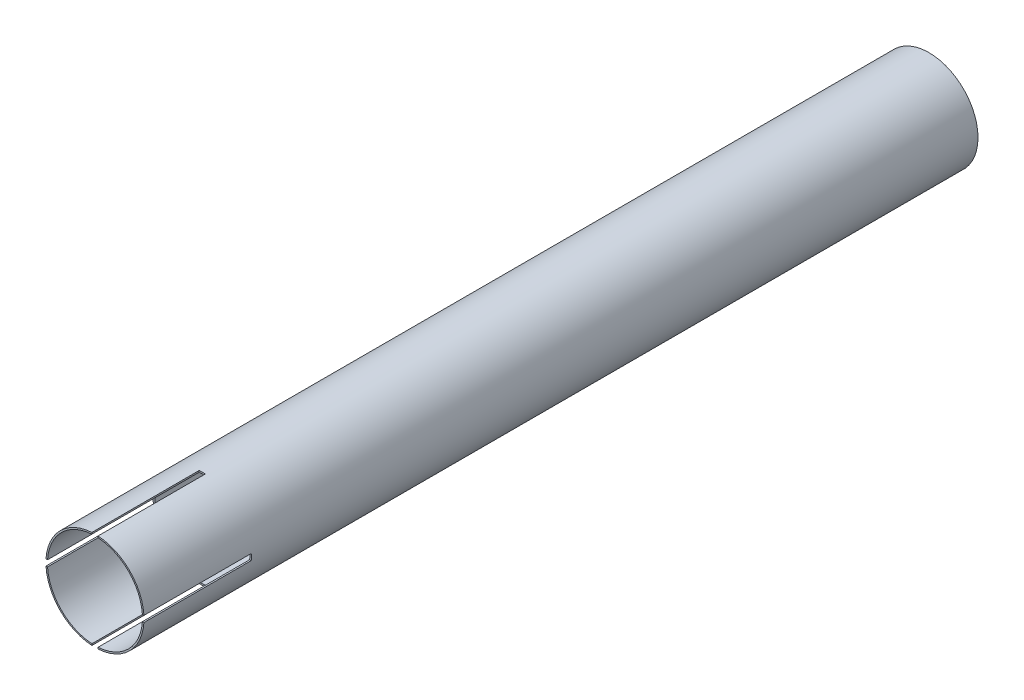
ISO-10303-21;
HEADER;
FILE_DESCRIPTION(('STEP AP214'),'2;1');
FILE_NAME('part.step','',(''),(''),'','','');
FILE_SCHEMA(('AUTOMOTIVE_DESIGN { 1 0 10303 214 1 1 1 1 }'));
ENDSEC;
DATA;
#1=APPLICATION_CONTEXT('core data for automotive mechanical design processes');
#2=APPLICATION_PROTOCOL_DEFINITION('international standard','automotive_design',2000,#1);
#3=PRODUCT_CONTEXT('',#1,'mechanical');
#4=PRODUCT('Part','Part','',(#3));
#5=PRODUCT_RELATED_PRODUCT_CATEGORY('part','',(#4));
#6=PRODUCT_DEFINITION_FORMATION('','',#4);
#7=PRODUCT_DEFINITION_CONTEXT('part definition',#1,'design');
#8=PRODUCT_DEFINITION('design','',#6,#7);
#9=PRODUCT_DEFINITION_SHAPE('','',#8);
#10=(LENGTH_UNIT() NAMED_UNIT(*) SI_UNIT(.MILLI.,.METRE.));
#11=(NAMED_UNIT(*) PLANE_ANGLE_UNIT() SI_UNIT($,.RADIAN.));
#12=(NAMED_UNIT(*) SI_UNIT($,.STERADIAN.) SOLID_ANGLE_UNIT());
#13=UNCERTAINTY_MEASURE_WITH_UNIT(LENGTH_MEASURE(1.E-05),#10,'distance_accuracy_value','');
#14=(GEOMETRIC_REPRESENTATION_CONTEXT(3) GLOBAL_UNCERTAINTY_ASSIGNED_CONTEXT((#13)) GLOBAL_UNIT_ASSIGNED_CONTEXT((#10,
#11,#12)) REPRESENTATION_CONTEXT('',''));
#15=CARTESIAN_POINT('',(0.,0.,0.));
#16=DIRECTION('',(0.,0.,1.));
#17=DIRECTION('',(1.,0.,0.));
#18=AXIS2_PLACEMENT_3D('',#15,#16,#17);
#19=CARTESIAN_POINT('',(0.,0.,863.6));
#20=DIRECTION('',(0.,0.,1.));
#21=DIRECTION('',(1.,0.,0.));
#22=AXIS2_PLACEMENT_3D('',#19,#20,#21);
#23=PLANE('',#22);
#24=DIRECTION('',(1.,0.,0.));
#25=VECTOR('',#24,1.);
#26=CARTESIAN_POINT('',(-50.8,3.175,863.6));
#27=LINE('',#26,#25);
#28=CARTESIAN_POINT('',(49.1099738469692,3.175,863.6));
#29=VERTEX_POINT('',#28);
#30=CARTESIAN_POINT('',(50.7006841669814,3.175,863.6));
#31=VERTEX_POINT('',#30);
#32=EDGE_CURVE('E289',#29,#31,#27,.T.);
#33=ORIENTED_EDGE('',*,*,#32,.T.);
#34=CARTESIAN_POINT('',(0.,0.,863.6));
#35=DIRECTION('',(0.,0.,1.));
#36=DIRECTION('',(1.,0.,0.));
#37=AXIS2_PLACEMENT_3D('',#34,#35,#36);
#38=CIRCLE('',#37,50.8);
#39=CARTESIAN_POINT('',(3.17500000000001,50.7006841669814,863.6));
#40=VERTEX_POINT('',#39);
#41=EDGE_CURVE('E247',#31,#40,#38,.T.);
#42=ORIENTED_EDGE('',*,*,#41,.T.);
#43=DIRECTION('',(0.,1.,0.));
#44=VECTOR('',#43,1.);
#45=CARTESIAN_POINT('',(3.17500000000001,-50.8,863.6));
#46=LINE('',#45,#44);
#47=CARTESIAN_POINT('',(3.17500000000001,49.1099738469692,863.6));
#48=VERTEX_POINT('',#47);
#49=EDGE_CURVE('E194',#48,#40,#46,.T.);
#50=ORIENTED_EDGE('',*,*,#49,.F.);
#51=CARTESIAN_POINT('',(0.,0.,863.6));
#52=DIRECTION('',(0.,0.,1.));
#53=DIRECTION('',(1.,0.,0.));
#54=AXIS2_PLACEMENT_3D('',#51,#52,#53);
#55=CIRCLE('',#54,49.2125);
#56=EDGE_CURVE('E238',#29,#48,#55,.T.);
#57=ORIENTED_EDGE('',*,*,#56,.F.);
#58=EDGE_LOOP('',(#33,#42,#50,#57));
#59=FACE_BOUND('',#58,.T.);
#60=ADVANCED_FACE('F38',(#59),#23,.T.);
#61=CARTESIAN_POINT('',(-50.7006841669814,3.175,863.6));
#62=VERTEX_POINT('',#61);
#63=CARTESIAN_POINT('',(-49.1099738469692,3.175,863.6));
#64=VERTEX_POINT('',#63);
#65=EDGE_CURVE('E182',#62,#64,#27,.T.);
#66=ORIENTED_EDGE('',*,*,#65,.T.);
#67=CARTESIAN_POINT('',(-3.175,49.1099738469692,863.6));
#68=VERTEX_POINT('',#67);
#69=EDGE_CURVE('E239',#68,#64,#55,.T.);
#70=ORIENTED_EDGE('',*,*,#69,.F.);
#71=DIRECTION('',(0.,1.,0.));
#72=VECTOR('',#71,1.);
#73=CARTESIAN_POINT('',(-3.175,-50.8,863.6));
#74=LINE('',#73,#72);
#75=CARTESIAN_POINT('',(-3.175,50.7006841669814,863.6));
#76=VERTEX_POINT('',#75);
#77=EDGE_CURVE('E200',#68,#76,#74,.T.);
#78=ORIENTED_EDGE('',*,*,#77,.T.);
#79=EDGE_CURVE('E248',#76,#62,#38,.T.);
#80=ORIENTED_EDGE('',*,*,#79,.T.);
#81=EDGE_LOOP('',(#66,#70,#78,#80));
#82=FACE_BOUND('',#81,.T.);
#83=ADVANCED_FACE('F322',(#82),#23,.T.);
#84=DIRECTION('',(1.,0.,0.));
#85=VECTOR('',#84,1.);
#86=CARTESIAN_POINT('',(-50.8,-3.175,863.6));
#87=LINE('',#86,#85);
#88=CARTESIAN_POINT('',(49.1099738469692,-3.175,863.6));
#89=VERTEX_POINT('',#88);
#90=CARTESIAN_POINT('',(50.7006841669814,-3.175,863.6));
#91=VERTEX_POINT('',#90);
#92=EDGE_CURVE('E361',#89,#91,#87,.T.);
#93=ORIENTED_EDGE('',*,*,#92,.F.);
#94=CARTESIAN_POINT('',(3.17500000000001,-49.1099738469692,863.6));
#95=VERTEX_POINT('',#94);
#96=EDGE_CURVE('E233',#95,#89,#55,.T.);
#97=ORIENTED_EDGE('',*,*,#96,.F.);
#98=CARTESIAN_POINT('',(3.17500000000001,-50.7006841669814,863.6));
#99=VERTEX_POINT('',#98);
#100=EDGE_CURVE('E198',#99,#95,#46,.T.);
#101=ORIENTED_EDGE('',*,*,#100,.F.);
#102=EDGE_CURVE('E243',#99,#91,#38,.T.);
#103=ORIENTED_EDGE('',*,*,#102,.T.);
#104=EDGE_LOOP('',(#93,#97,#101,#103));
#105=FACE_BOUND('',#104,.T.);
#106=ADVANCED_FACE('F349',(#105),#23,.T.);
#107=CARTESIAN_POINT('',(-50.7006841669814,-3.175,863.6));
#108=VERTEX_POINT('',#107);
#109=CARTESIAN_POINT('',(-49.1099738469692,-3.175,863.6));
#110=VERTEX_POINT('',#109);
#111=EDGE_CURVE('E62',#108,#110,#87,.T.);
#112=ORIENTED_EDGE('',*,*,#111,.F.);
#113=CARTESIAN_POINT('',(-3.175,-50.7006841669814,863.6));
#114=VERTEX_POINT('',#113);
#115=EDGE_CURVE('E176',#108,#114,#38,.T.);
#116=ORIENTED_EDGE('',*,*,#115,.T.);
#117=CARTESIAN_POINT('',(-3.175,-49.1099738469692,863.6));
#118=VERTEX_POINT('',#117);
#119=EDGE_CURVE('E199',#114,#118,#74,.T.);
#120=ORIENTED_EDGE('',*,*,#119,.T.);
#121=EDGE_CURVE('E237',#110,#118,#55,.T.);
#122=ORIENTED_EDGE('',*,*,#121,.F.);
#123=EDGE_LOOP('',(#112,#116,#120,#122));
#124=FACE_BOUND('',#123,.T.);
#125=ADVANCED_FACE('F345',(#124),#23,.T.);
#126=CARTESIAN_POINT('',(0.,0.,0.));
#127=DIRECTION('',(0.,0.,1.));
#128=DIRECTION('',(1.,0.,0.));
#129=AXIS2_PLACEMENT_3D('',#126,#127,#128);
#130=PLANE('',#129);
#131=CARTESIAN_POINT('',(0.,0.,0.));
#132=DIRECTION('',(0.,0.,1.));
#133=DIRECTION('',(1.,0.,0.));
#134=AXIS2_PLACEMENT_3D('',#131,#132,#133);
#135=CIRCLE('',#134,50.8);
#136=CARTESIAN_POINT('',(50.8,0.,0.));
#137=VERTEX_POINT('',#136);
#138=EDGE_CURVE('E249',#137,#137,#135,.T.);
#139=ORIENTED_EDGE('',*,*,#138,.F.);
#140=EDGE_LOOP('',(#139));
#141=FACE_BOUND('',#140,.T.);
#142=CARTESIAN_POINT('',(0.,0.,0.));
#143=DIRECTION('',(0.,0.,1.));
#144=DIRECTION('',(1.,0.,0.));
#145=AXIS2_PLACEMENT_3D('',#142,#143,#144);
#146=CIRCLE('',#145,49.2125);
#147=CARTESIAN_POINT('',(49.2125,0.,0.));
#148=VERTEX_POINT('',#147);
#149=EDGE_CURVE('E232',#148,#148,#146,.T.);
#150=ORIENTED_EDGE('',*,*,#149,.T.);
#151=EDGE_LOOP('',(#150));
#152=FACE_BOUND('',#151,.T.);
#153=ADVANCED_FACE('F352',(#141,#152),#130,.F.);
#154=CARTESIAN_POINT('',(0.,0.,863.6));
#155=DIRECTION('',(0.,0.,-1.));
#156=DIRECTION('',(-1.,0.,0.));
#157=AXIS2_PLACEMENT_3D('',#154,#155,#156);
#158=CYLINDRICAL_SURFACE('',#157,50.8);
#159=ORIENTED_EDGE('',*,*,#41,.F.);
#160=DIRECTION('',(0.,0.,-1.));
#161=VECTOR('',#160,1.);
#162=CARTESIAN_POINT('',(50.7006841669814,3.175,863.6));
#163=LINE('',#162,#161);
#164=CARTESIAN_POINT('',(50.7006841669814,3.175,752.475));
#165=VERTEX_POINT('',#164);
#166=EDGE_CURVE('E189',#31,#165,#163,.T.);
#167=ORIENTED_EDGE('',*,*,#166,.T.);
#168=CARTESIAN_POINT('',(0.,0.,752.475));
#169=DIRECTION('',(0.,0.,-1.));
#170=DIRECTION('',(-1.,0.,0.));
#171=AXIS2_PLACEMENT_3D('',#168,#169,#170);
#172=CIRCLE('',#171,50.8);
#173=CARTESIAN_POINT('',(50.7006841669814,-3.175,752.475));
#174=VERTEX_POINT('',#173);
#175=EDGE_CURVE('E164',#165,#174,#172,.T.);
#176=ORIENTED_EDGE('',*,*,#175,.T.);
#177=DIRECTION('',(0.,0.,-1.));
#178=VECTOR('',#177,1.);
#179=CARTESIAN_POINT('',(50.7006841669814,-3.175,863.6));
#180=LINE('',#179,#178);
#181=EDGE_CURVE('E178',#174,#91,#180,.F.);
#182=ORIENTED_EDGE('',*,*,#181,.T.);
#183=ORIENTED_EDGE('',*,*,#102,.F.);
#184=DIRECTION('',(0.,0.,-1.));
#185=VECTOR('',#184,1.);
#186=CARTESIAN_POINT('',(3.17500000000001,-50.7006841669814,863.6));
#187=LINE('',#186,#185);
#188=CARTESIAN_POINT('',(3.175,-50.7006841669814,752.475));
#189=VERTEX_POINT('',#188);
#190=EDGE_CURVE('E228',#99,#189,#187,.T.);
#191=ORIENTED_EDGE('',*,*,#190,.T.);
#192=CARTESIAN_POINT('',(0.,0.,752.475));
#193=DIRECTION('',(0.,0.,-1.));
#194=DIRECTION('',(-1.,0.,0.));
#195=AXIS2_PLACEMENT_3D('',#192,#193,#194);
#196=CIRCLE('',#195,50.8);
#197=CARTESIAN_POINT('',(-3.175,-50.7006841669814,752.475));
#198=VERTEX_POINT('',#197);
#199=EDGE_CURVE('E217',#189,#198,#196,.T.);
#200=ORIENTED_EDGE('',*,*,#199,.T.);
#201=DIRECTION('',(0.,0.,-1.));
#202=VECTOR('',#201,1.);
#203=CARTESIAN_POINT('',(-3.175,-50.7006841669814,863.6));
#204=LINE('',#203,#202);
#205=EDGE_CURVE('E216',#198,#114,#204,.F.);
#206=ORIENTED_EDGE('',*,*,#205,.T.);
#207=ORIENTED_EDGE('',*,*,#115,.F.);
#208=DIRECTION('',(0.,0.,-1.));
#209=VECTOR('',#208,1.);
#210=CARTESIAN_POINT('',(-50.7006841669814,-3.175,863.6));
#211=LINE('',#210,#209);
#212=CARTESIAN_POINT('',(-50.7006841669814,-3.175,752.475));
#213=VERTEX_POINT('',#212);
#214=EDGE_CURVE('E165',#108,#213,#211,.T.);
#215=ORIENTED_EDGE('',*,*,#214,.T.);
#216=CARTESIAN_POINT('',(-50.7006841669814,3.175,752.475));
#217=VERTEX_POINT('',#216);
#218=EDGE_CURVE('E152',#213,#217,#172,.T.);
#219=ORIENTED_EDGE('',*,*,#218,.T.);
#220=DIRECTION('',(0.,0.,-1.));
#221=VECTOR('',#220,1.);
#222=CARTESIAN_POINT('',(-50.7006841669814,3.175,863.6));
#223=LINE('',#222,#221);
#224=EDGE_CURVE('E186',#217,#62,#223,.F.);
#225=ORIENTED_EDGE('',*,*,#224,.T.);
#226=ORIENTED_EDGE('',*,*,#79,.F.);
#227=DIRECTION('',(0.,0.,-1.));
#228=VECTOR('',#227,1.);
#229=CARTESIAN_POINT('',(-3.175,50.7006841669814,863.6));
#230=LINE('',#229,#228);
#231=CARTESIAN_POINT('',(-3.175,50.7006841669814,752.475));
#232=VERTEX_POINT('',#231);
#233=EDGE_CURVE('E220',#76,#232,#230,.T.);
#234=ORIENTED_EDGE('',*,*,#233,.T.);
#235=CARTESIAN_POINT('',(3.175,50.7006841669814,752.475));
#236=VERTEX_POINT('',#235);
#237=EDGE_CURVE('E213',#232,#236,#196,.T.);
#238=ORIENTED_EDGE('',*,*,#237,.T.);
#239=DIRECTION('',(0.,0.,-1.));
#240=VECTOR('',#239,1.);
#241=CARTESIAN_POINT('',(3.17500000000001,50.7006841669814,863.6));
#242=LINE('',#241,#240);
#243=EDGE_CURVE('E224',#236,#40,#242,.F.);
#244=ORIENTED_EDGE('',*,*,#243,.T.);
#245=EDGE_LOOP('',(#159,#167,#176,#182,#183,#191,#200,#206,#207,#215,#219,#225,#226,#234,#238,#244));
#246=FACE_BOUND('',#245,.T.);
#247=ORIENTED_EDGE('',*,*,#138,.T.);
#248=EDGE_LOOP('',(#247));
#249=FACE_BOUND('',#248,.T.);
#250=ADVANCED_FACE('F40',(#246,#249),#158,.T.);
#251=CARTESIAN_POINT('',(0.,0.,863.6));
#252=DIRECTION('',(0.,0.,-1.));
#253=DIRECTION('',(-1.,0.,0.));
#254=AXIS2_PLACEMENT_3D('',#251,#252,#253);
#255=CYLINDRICAL_SURFACE('',#254,49.2125);
#256=DIRECTION('',(0.,0.,-1.));
#257=VECTOR('',#256,1.);
#258=CARTESIAN_POINT('',(-49.1099738469692,3.175,863.6));
#259=LINE('',#258,#257);
#260=CARTESIAN_POINT('',(-49.1099738469692,3.175,752.475));
#261=VERTEX_POINT('',#260);
#262=EDGE_CURVE('E11',#261,#64,#259,.F.);
#263=ORIENTED_EDGE('',*,*,#262,.F.);
#264=CARTESIAN_POINT('',(0.,0.,752.475));
#265=DIRECTION('',(0.,0.,-1.));
#266=DIRECTION('',(-1.,0.,0.));
#267=AXIS2_PLACEMENT_3D('',#264,#265,#266);
#268=CIRCLE('',#267,49.2125);
#269=CARTESIAN_POINT('',(-49.1099738469692,-3.175,752.475));
#270=VERTEX_POINT('',#269);
#271=EDGE_CURVE('E47',#270,#261,#268,.T.);
#272=ORIENTED_EDGE('',*,*,#271,.F.);
#273=DIRECTION('',(0.,0.,-1.));
#274=VECTOR('',#273,1.);
#275=CARTESIAN_POINT('',(-49.1099738469692,-3.175,863.6));
#276=LINE('',#275,#274);
#277=EDGE_CURVE('E168',#110,#270,#276,.T.);
#278=ORIENTED_EDGE('',*,*,#277,.F.);
#279=ORIENTED_EDGE('',*,*,#121,.T.);
#280=DIRECTION('',(0.,0.,-1.));
#281=VECTOR('',#280,1.);
#282=CARTESIAN_POINT('',(-3.175,-49.1099738469692,863.6));
#283=LINE('',#282,#281);
#284=CARTESIAN_POINT('',(-3.175,-49.1099738469692,752.475));
#285=VERTEX_POINT('',#284);
#286=EDGE_CURVE('E256',#285,#118,#283,.F.);
#287=ORIENTED_EDGE('',*,*,#286,.F.);
#288=CARTESIAN_POINT('',(0.,0.,752.475));
#289=DIRECTION('',(0.,0.,-1.));
#290=DIRECTION('',(-1.,0.,0.));
#291=AXIS2_PLACEMENT_3D('',#288,#289,#290);
#292=CIRCLE('',#291,49.2125);
#293=CARTESIAN_POINT('',(3.175,-49.1099738469692,752.475));
#294=VERTEX_POINT('',#293);
#295=EDGE_CURVE('E253',#294,#285,#292,.T.);
#296=ORIENTED_EDGE('',*,*,#295,.F.);
#297=DIRECTION('',(0.,0.,-1.));
#298=VECTOR('',#297,1.);
#299=CARTESIAN_POINT('',(3.17500000000001,-49.1099738469692,863.6));
#300=LINE('',#299,#298);
#301=EDGE_CURVE('E261',#95,#294,#300,.T.);
#302=ORIENTED_EDGE('',*,*,#301,.F.);
#303=ORIENTED_EDGE('',*,*,#96,.T.);
#304=DIRECTION('',(0.,0.,-1.));
#305=VECTOR('',#304,1.);
#306=CARTESIAN_POINT('',(49.1099738469692,-3.175,863.6));
#307=LINE('',#306,#305);
#308=CARTESIAN_POINT('',(49.1099738469692,-3.175,752.475));
#309=VERTEX_POINT('',#308);
#310=EDGE_CURVE('E273',#309,#89,#307,.F.);
#311=ORIENTED_EDGE('',*,*,#310,.F.);
#312=CARTESIAN_POINT('',(49.1099738469692,3.175,752.475));
#313=VERTEX_POINT('',#312);
#314=EDGE_CURVE('E276',#313,#309,#268,.T.);
#315=ORIENTED_EDGE('',*,*,#314,.F.);
#316=DIRECTION('',(0.,0.,-1.));
#317=VECTOR('',#316,1.);
#318=CARTESIAN_POINT('',(49.1099738469692,3.175,863.6));
#319=LINE('',#318,#317);
#320=EDGE_CURVE('E279',#29,#313,#319,.T.);
#321=ORIENTED_EDGE('',*,*,#320,.F.);
#322=ORIENTED_EDGE('',*,*,#56,.T.);
#323=DIRECTION('',(0.,0.,-1.));
#324=VECTOR('',#323,1.);
#325=CARTESIAN_POINT('',(3.17500000000001,49.1099738469692,863.6));
#326=LINE('',#325,#324);
#327=CARTESIAN_POINT('',(3.175,49.1099738469692,752.475));
#328=VERTEX_POINT('',#327);
#329=EDGE_CURVE('E269',#328,#48,#326,.F.);
#330=ORIENTED_EDGE('',*,*,#329,.F.);
#331=CARTESIAN_POINT('',(-3.175,49.1099738469692,752.475));
#332=VERTEX_POINT('',#331);
#333=EDGE_CURVE('E257',#332,#328,#292,.T.);
#334=ORIENTED_EDGE('',*,*,#333,.F.);
#335=DIRECTION('',(0.,0.,-1.));
#336=VECTOR('',#335,1.);
#337=CARTESIAN_POINT('',(-3.175,49.1099738469692,863.6));
#338=LINE('',#337,#336);
#339=EDGE_CURVE('E265',#68,#332,#338,.T.);
#340=ORIENTED_EDGE('',*,*,#339,.F.);
#341=ORIENTED_EDGE('',*,*,#69,.T.);
#342=EDGE_LOOP('',(#263,#272,#278,#279,#287,#296,#302,#303,#311,#315,#321,#322,#330,#334,#340,#341));
#343=FACE_BOUND('',#342,.T.);
#344=ORIENTED_EDGE('',*,*,#149,.F.);
#345=EDGE_LOOP('',(#344));
#346=FACE_BOUND('',#345,.T.);
#347=ADVANCED_FACE('F292',(#343,#346),#255,.F.);
#348=CARTESIAN_POINT('',(3.175,-50.8,752.475));
#349=DIRECTION('',(0.,0.,-1.));
#350=DIRECTION('',(-1.,0.,0.));
#351=AXIS2_PLACEMENT_3D('',#348,#349,#350);
#352=PLANE('',#351);
#353=DIRECTION('',(0.,1.,0.));
#354=VECTOR('',#353,1.);
#355=CARTESIAN_POINT('',(3.175,-50.8,752.475));
#356=LINE('',#355,#354);
#357=EDGE_CURVE('E209',#189,#294,#356,.T.);
#358=ORIENTED_EDGE('',*,*,#357,.T.);
#359=ORIENTED_EDGE('',*,*,#295,.T.);
#360=DIRECTION('',(0.,1.,0.));
#361=VECTOR('',#360,1.);
#362=CARTESIAN_POINT('',(-3.175,-50.8,752.475));
#363=LINE('',#362,#361);
#364=EDGE_CURVE('E204',#198,#285,#363,.T.);
#365=ORIENTED_EDGE('',*,*,#364,.F.);
#366=ORIENTED_EDGE('',*,*,#199,.F.);
#367=EDGE_LOOP('',(#358,#359,#365,#366));
#368=FACE_BOUND('',#367,.T.);
#369=ADVANCED_FACE('F331',(#368),#352,.F.);
#370=CARTESIAN_POINT('',(-3.175,-50.8,863.6));
#371=DIRECTION('',(-1.,0.,0.));
#372=DIRECTION('',(0.,0.,1.));
#373=AXIS2_PLACEMENT_3D('',#370,#371,#372);
#374=PLANE('',#373);
#375=ORIENTED_EDGE('',*,*,#364,.T.);
#376=ORIENTED_EDGE('',*,*,#286,.T.);
#377=ORIENTED_EDGE('',*,*,#119,.F.);
#378=ORIENTED_EDGE('',*,*,#205,.F.);
#379=EDGE_LOOP('',(#375,#376,#377,#378));
#380=FACE_BOUND('',#379,.T.);
#381=ADVANCED_FACE('F339',(#380),#374,.F.);
#382=CARTESIAN_POINT('',(3.17500000000001,-50.8,863.6));
#383=DIRECTION('',(1.,0.,0.));
#384=DIRECTION('',(0.,0.,-1.));
#385=AXIS2_PLACEMENT_3D('',#382,#383,#384);
#386=PLANE('',#385);
#387=ORIENTED_EDGE('',*,*,#100,.T.);
#388=ORIENTED_EDGE('',*,*,#301,.T.);
#389=ORIENTED_EDGE('',*,*,#357,.F.);
#390=ORIENTED_EDGE('',*,*,#190,.F.);
#391=EDGE_LOOP('',(#387,#388,#389,#390));
#392=FACE_BOUND('',#391,.T.);
#393=ADVANCED_FACE('F383',(#392),#386,.F.);
#394=EDGE_CURVE('E193',#328,#236,#356,.T.);
#395=ORIENTED_EDGE('',*,*,#394,.F.);
#396=ORIENTED_EDGE('',*,*,#329,.T.);
#397=ORIENTED_EDGE('',*,*,#49,.T.);
#398=ORIENTED_EDGE('',*,*,#243,.F.);
#399=EDGE_LOOP('',(#395,#396,#397,#398));
#400=FACE_BOUND('',#399,.T.);
#401=ADVANCED_FACE('F312',(#400),#386,.F.);
#402=ORIENTED_EDGE('',*,*,#77,.F.);
#403=ORIENTED_EDGE('',*,*,#339,.T.);
#404=EDGE_CURVE('E205',#332,#232,#363,.T.);
#405=ORIENTED_EDGE('',*,*,#404,.T.);
#406=ORIENTED_EDGE('',*,*,#233,.F.);
#407=EDGE_LOOP('',(#402,#403,#405,#406));
#408=FACE_BOUND('',#407,.T.);
#409=ADVANCED_FACE('F324',(#408),#374,.F.);
#410=ORIENTED_EDGE('',*,*,#404,.F.);
#411=ORIENTED_EDGE('',*,*,#333,.T.);
#412=ORIENTED_EDGE('',*,*,#394,.T.);
#413=ORIENTED_EDGE('',*,*,#237,.F.);
#414=EDGE_LOOP('',(#410,#411,#412,#413));
#415=FACE_BOUND('',#414,.T.);
#416=ADVANCED_FACE('F326',(#415),#352,.F.);
#417=CARTESIAN_POINT('',(-50.8,-3.175,863.6));
#418=DIRECTION('',(0.,-1.,0.));
#419=DIRECTION('',(0.,0.,-1.));
#420=AXIS2_PLACEMENT_3D('',#417,#418,#419);
#421=PLANE('',#420);
#422=DIRECTION('',(1.,0.,0.));
#423=VECTOR('',#422,1.);
#424=CARTESIAN_POINT('',(-50.8,-3.175,752.475));
#425=LINE('',#424,#423);
#426=EDGE_CURVE('E54',#309,#174,#425,.T.);
#427=ORIENTED_EDGE('',*,*,#426,.F.);
#428=ORIENTED_EDGE('',*,*,#310,.T.);
#429=ORIENTED_EDGE('',*,*,#92,.T.);
#430=ORIENTED_EDGE('',*,*,#181,.F.);
#431=EDGE_LOOP('',(#427,#428,#429,#430));
#432=FACE_BOUND('',#431,.T.);
#433=ADVANCED_FACE('F329',(#432),#421,.F.);
#434=CARTESIAN_POINT('',(-50.8,3.175,752.475));
#435=DIRECTION('',(0.,0.,-1.));
#436=DIRECTION('',(-1.,0.,0.));
#437=AXIS2_PLACEMENT_3D('',#434,#435,#436);
#438=PLANE('',#437);
#439=DIRECTION('',(1.,0.,0.));
#440=VECTOR('',#439,1.);
#441=CARTESIAN_POINT('',(-50.8,3.175,752.475));
#442=LINE('',#441,#440);
#443=EDGE_CURVE('E170',#313,#165,#442,.T.);
#444=ORIENTED_EDGE('',*,*,#443,.F.);
#445=ORIENTED_EDGE('',*,*,#314,.T.);
#446=ORIENTED_EDGE('',*,*,#426,.T.);
#447=ORIENTED_EDGE('',*,*,#175,.F.);
#448=EDGE_LOOP('',(#444,#445,#446,#447));
#449=FACE_BOUND('',#448,.T.);
#450=ADVANCED_FACE('F336',(#449),#438,.F.);
#451=CARTESIAN_POINT('',(-50.8,3.175,863.6));
#452=DIRECTION('',(0.,1.,0.));
#453=DIRECTION('',(0.,0.,1.));
#454=AXIS2_PLACEMENT_3D('',#451,#452,#453);
#455=PLANE('',#454);
#456=ORIENTED_EDGE('',*,*,#32,.F.);
#457=ORIENTED_EDGE('',*,*,#320,.T.);
#458=ORIENTED_EDGE('',*,*,#443,.T.);
#459=ORIENTED_EDGE('',*,*,#166,.F.);
#460=EDGE_LOOP('',(#456,#457,#458,#459));
#461=FACE_BOUND('',#460,.T.);
#462=ADVANCED_FACE('F371',(#461),#455,.F.);
#463=EDGE_CURVE('E158',#217,#261,#442,.T.);
#464=ORIENTED_EDGE('',*,*,#463,.T.);
#465=ORIENTED_EDGE('',*,*,#262,.T.);
#466=ORIENTED_EDGE('',*,*,#65,.F.);
#467=ORIENTED_EDGE('',*,*,#224,.F.);
#468=EDGE_LOOP('',(#464,#465,#466,#467));
#469=FACE_BOUND('',#468,.T.);
#470=ADVANCED_FACE('F286',(#469),#455,.F.);
#471=ORIENTED_EDGE('',*,*,#218,.F.);
#472=EDGE_CURVE('E155',#213,#270,#425,.T.);
#473=ORIENTED_EDGE('',*,*,#472,.T.);
#474=ORIENTED_EDGE('',*,*,#271,.T.);
#475=ORIENTED_EDGE('',*,*,#463,.F.);
#476=EDGE_LOOP('',(#471,#473,#474,#475));
#477=FACE_BOUND('',#476,.T.);
#478=ADVANCED_FACE('F154',(#477),#438,.F.);
#479=ORIENTED_EDGE('',*,*,#111,.T.);
#480=ORIENTED_EDGE('',*,*,#277,.T.);
#481=ORIENTED_EDGE('',*,*,#472,.F.);
#482=ORIENTED_EDGE('',*,*,#214,.F.);
#483=EDGE_LOOP('',(#479,#480,#481,#482));
#484=FACE_BOUND('',#483,.T.);
#485=ADVANCED_FACE('F167',(#484),#421,.F.);
#486=CLOSED_SHELL('',(#60,#83,#106,#125,#153,#250,#347,#369,#381,#393,#401,#409,#416,#433,#450,
#462,#470,#478,#485));
#487=MANIFOLD_SOLID_BREP('B2',#486);
#488=ADVANCED_BREP_SHAPE_REPRESENTATION('',(#18,#487),#14);
#489=SHAPE_DEFINITION_REPRESENTATION(#9,#488);
ENDSEC;
END-ISO-10303-21;
